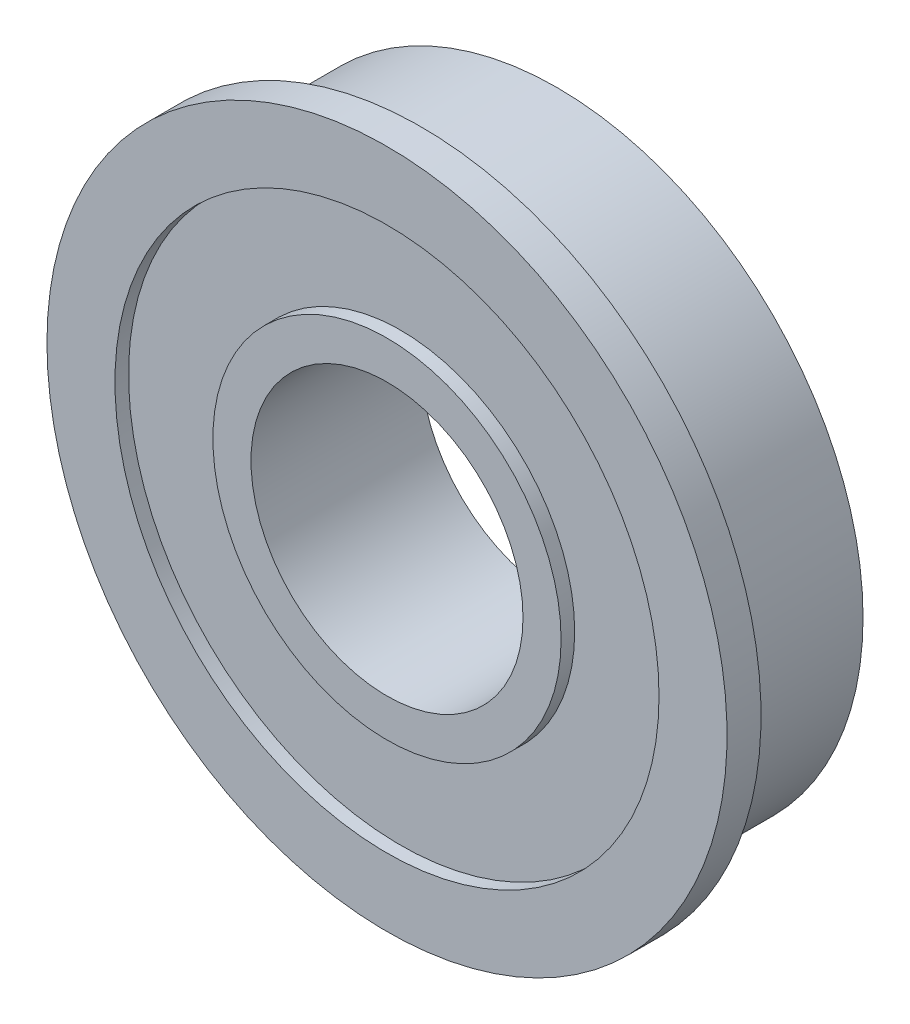
ISO-10303-21;
HEADER;
FILE_DESCRIPTION(('STEP AP214'),'2;1');
FILE_NAME('part.step','',(''),(''),'','','');
FILE_SCHEMA(('AUTOMOTIVE_DESIGN { 1 0 10303 214 1 1 1 1 }'));
ENDSEC;
DATA;
#1=APPLICATION_CONTEXT('core data for automotive mechanical design processes');
#2=APPLICATION_PROTOCOL_DEFINITION('international standard','automotive_design',2000,#1);
#3=PRODUCT_CONTEXT('',#1,'mechanical');
#4=PRODUCT('Part','Part','',(#3));
#5=PRODUCT_RELATED_PRODUCT_CATEGORY('part','',(#4));
#6=PRODUCT_DEFINITION_FORMATION('','',#4);
#7=PRODUCT_DEFINITION_CONTEXT('part definition',#1,'design');
#8=PRODUCT_DEFINITION('design','',#6,#7);
#9=PRODUCT_DEFINITION_SHAPE('','',#8);
#10=(LENGTH_UNIT() NAMED_UNIT(*) SI_UNIT(.MILLI.,.METRE.));
#11=(NAMED_UNIT(*) PLANE_ANGLE_UNIT() SI_UNIT($,.RADIAN.));
#12=(NAMED_UNIT(*) SI_UNIT($,.STERADIAN.) SOLID_ANGLE_UNIT());
#13=UNCERTAINTY_MEASURE_WITH_UNIT(LENGTH_MEASURE(1.E-05),#10,'distance_accuracy_value','');
#14=(GEOMETRIC_REPRESENTATION_CONTEXT(3) GLOBAL_UNCERTAINTY_ASSIGNED_CONTEXT((#13)) GLOBAL_UNIT_ASSIGNED_CONTEXT((#10,
#11,#12)) REPRESENTATION_CONTEXT('',''));
#15=CARTESIAN_POINT('',(0.,0.,0.));
#16=DIRECTION('',(0.,0.,1.));
#17=DIRECTION('',(1.,0.,0.));
#18=AXIS2_PLACEMENT_3D('',#15,#16,#17);
#19=CARTESIAN_POINT('',(0.738909090909089,0.,3.96875));
#20=DIRECTION('',(0.,0.,1.));
#21=DIRECTION('',(1.,0.,0.));
#22=AXIS2_PLACEMENT_3D('',#19,#20,#21);
#23=PLANE('',#22);
#24=CARTESIAN_POINT('',(0.,0.,3.96875));
#25=DIRECTION('',(0.,0.,1.));
#26=DIRECTION('',(1.,0.,0.));
#27=AXIS2_PLACEMENT_3D('',#24,#25,#26);
#28=CIRCLE('',#27,6.35);
#29=CARTESIAN_POINT('',(6.35,0.,3.96875));
#30=VERTEX_POINT('',#29);
#31=EDGE_CURVE('E58',#30,#30,#28,.F.);
#32=ORIENTED_EDGE('',*,*,#31,.T.);
#33=EDGE_LOOP('',(#32));
#34=FACE_BOUND('',#33,.T.);
#35=CARTESIAN_POINT('',(0.,0.,3.96875));
#36=DIRECTION('',(0.,0.,1.));
#37=DIRECTION('',(1.,0.,0.));
#38=AXIS2_PLACEMENT_3D('',#35,#36,#37);
#39=CIRCLE('',#38,8.128);
#40=CARTESIAN_POINT('',(8.128,0.,3.96875));
#41=VERTEX_POINT('',#40);
#42=EDGE_CURVE('E18',#41,#41,#39,.F.);
#43=ORIENTED_EDGE('',*,*,#42,.F.);
#44=EDGE_LOOP('',(#43));
#45=FACE_BOUND('',#44,.T.);
#46=ADVANCED_FACE('F15',(#34,#45),#23,.T.);
#47=CARTESIAN_POINT('',(0.,0.,0.));
#48=DIRECTION('',(0.,0.,1.));
#49=DIRECTION('',(1.,0.,0.));
#50=AXIS2_PLACEMENT_3D('',#47,#48,#49);
#51=CYLINDRICAL_SURFACE('',#50,8.128);
#52=CARTESIAN_POINT('',(0.,0.,3.33375));
#53=DIRECTION('',(0.,0.,1.));
#54=DIRECTION('',(1.,0.,0.));
#55=AXIS2_PLACEMENT_3D('',#52,#53,#54);
#56=CIRCLE('',#55,8.128);
#57=CARTESIAN_POINT('',(8.128,0.,3.33375));
#58=VERTEX_POINT('',#57);
#59=EDGE_CURVE('E56',#58,#58,#56,.F.);
#60=ORIENTED_EDGE('',*,*,#59,.F.);
#61=EDGE_LOOP('',(#60));
#62=FACE_BOUND('',#61,.T.);
#63=ORIENTED_EDGE('',*,*,#42,.T.);
#64=EDGE_LOOP('',(#63));
#65=FACE_BOUND('',#64,.T.);
#66=ADVANCED_FACE('F65',(#62,#65),#51,.T.);
#67=CARTESIAN_POINT('',(0.,0.,0.));
#68=DIRECTION('',(0.,0.,1.));
#69=DIRECTION('',(1.,0.,0.));
#70=AXIS2_PLACEMENT_3D('',#67,#68,#69);
#71=CYLINDRICAL_SURFACE('',#70,6.35);
#72=ORIENTED_EDGE('',*,*,#31,.F.);
#73=EDGE_LOOP('',(#72));
#74=FACE_BOUND('',#73,.T.);
#75=CARTESIAN_POINT('',(0.,0.,-3.96875));
#76=DIRECTION('',(0.,0.,1.));
#77=DIRECTION('',(1.,0.,0.));
#78=AXIS2_PLACEMENT_3D('',#75,#76,#77);
#79=CIRCLE('',#78,6.35);
#80=CARTESIAN_POINT('',(6.35,0.,-3.96875));
#81=VERTEX_POINT('',#80);
#82=EDGE_CURVE('E53',#81,#81,#79,.F.);
#83=ORIENTED_EDGE('',*,*,#82,.T.);
#84=EDGE_LOOP('',(#83));
#85=FACE_BOUND('',#84,.T.);
#86=ADVANCED_FACE('F72',(#74,#85),#71,.F.);
#87=CARTESIAN_POINT('',(1.15454545454544,0.,3.33375));
#88=DIRECTION('',(0.,0.,1.));
#89=DIRECTION('',(1.,0.,0.));
#90=AXIS2_PLACEMENT_3D('',#87,#88,#89);
#91=PLANE('',#90);
#92=ORIENTED_EDGE('',*,*,#59,.T.);
#93=EDGE_LOOP('',(#92));
#94=FACE_BOUND('',#93,.T.);
#95=CARTESIAN_POINT('',(0.,0.,3.33375));
#96=DIRECTION('',(0.,0.,1.));
#97=DIRECTION('',(1.,0.,0.));
#98=AXIS2_PLACEMENT_3D('',#95,#96,#97);
#99=CIRCLE('',#98,12.7);
#100=CARTESIAN_POINT('',(12.7,0.,3.33375));
#101=VERTEX_POINT('',#100);
#102=EDGE_CURVE('E50',#101,#101,#99,.T.);
#103=ORIENTED_EDGE('',*,*,#102,.T.);
#104=EDGE_LOOP('',(#103));
#105=FACE_BOUND('',#104,.T.);
#106=ADVANCED_FACE('F116',(#94,#105),#91,.T.);
#107=CARTESIAN_POINT('',(0.738909090909089,0.,-3.96875));
#108=DIRECTION('',(0.,0.,1.));
#109=DIRECTION('',(1.,0.,0.));
#110=AXIS2_PLACEMENT_3D('',#107,#108,#109);
#111=PLANE('',#110);
#112=ORIENTED_EDGE('',*,*,#82,.F.);
#113=EDGE_LOOP('',(#112));
#114=FACE_BOUND('',#113,.T.);
#115=CARTESIAN_POINT('',(0.,0.,-3.96875));
#116=DIRECTION('',(0.,0.,1.));
#117=DIRECTION('',(1.,0.,0.));
#118=AXIS2_PLACEMENT_3D('',#115,#116,#117);
#119=CIRCLE('',#118,8.128);
#120=CARTESIAN_POINT('',(8.128,0.,-3.96875));
#121=VERTEX_POINT('',#120);
#122=EDGE_CURVE('E47',#121,#121,#119,.T.);
#123=ORIENTED_EDGE('',*,*,#122,.F.);
#124=EDGE_LOOP('',(#123));
#125=FACE_BOUND('',#124,.T.);
#126=ADVANCED_FACE('F112',(#114,#125),#111,.F.);
#127=CARTESIAN_POINT('',(0.,0.,0.));
#128=DIRECTION('',(0.,0.,1.));
#129=DIRECTION('',(1.,0.,0.));
#130=AXIS2_PLACEMENT_3D('',#127,#128,#129);
#131=CYLINDRICAL_SURFACE('',#130,12.7);
#132=ORIENTED_EDGE('',*,*,#102,.F.);
#133=EDGE_LOOP('',(#132));
#134=FACE_BOUND('',#133,.T.);
#135=CARTESIAN_POINT('',(0.,0.,3.96875));
#136=DIRECTION('',(0.,0.,1.));
#137=DIRECTION('',(1.,0.,0.));
#138=AXIS2_PLACEMENT_3D('',#135,#136,#137);
#139=CIRCLE('',#138,12.7);
#140=CARTESIAN_POINT('',(12.7,0.,3.96875));
#141=VERTEX_POINT('',#140);
#142=EDGE_CURVE('E44',#141,#141,#139,.F.);
#143=ORIENTED_EDGE('',*,*,#142,.F.);
#144=EDGE_LOOP('',(#143));
#145=FACE_BOUND('',#144,.T.);
#146=ADVANCED_FACE('F108',(#134,#145),#131,.F.);
#147=CARTESIAN_POINT('',(0.,0.,0.));
#148=DIRECTION('',(0.,0.,1.));
#149=DIRECTION('',(1.,0.,0.));
#150=AXIS2_PLACEMENT_3D('',#147,#148,#149);
#151=CYLINDRICAL_SURFACE('',#150,8.128);
#152=ORIENTED_EDGE('',*,*,#122,.T.);
#153=EDGE_LOOP('',(#152));
#154=FACE_BOUND('',#153,.T.);
#155=CARTESIAN_POINT('',(0.,0.,-3.33375));
#156=DIRECTION('',(0.,0.,1.));
#157=DIRECTION('',(1.,0.,0.));
#158=AXIS2_PLACEMENT_3D('',#155,#156,#157);
#159=CIRCLE('',#158,8.128);
#160=CARTESIAN_POINT('',(8.128,0.,-3.33375));
#161=VERTEX_POINT('',#160);
#162=EDGE_CURVE('E41',#161,#161,#159,.F.);
#163=ORIENTED_EDGE('',*,*,#162,.T.);
#164=EDGE_LOOP('',(#163));
#165=FACE_BOUND('',#164,.T.);
#166=ADVANCED_FACE('F104',(#154,#165),#151,.T.);
#167=CARTESIAN_POINT('',(1.29886363636365,0.,3.96875));
#168=DIRECTION('',(0.,0.,1.));
#169=DIRECTION('',(1.,0.,0.));
#170=AXIS2_PLACEMENT_3D('',#167,#168,#169);
#171=PLANE('',#170);
#172=ORIENTED_EDGE('',*,*,#142,.T.);
#173=EDGE_LOOP('',(#172));
#174=FACE_BOUND('',#173,.T.);
#175=CARTESIAN_POINT('',(0.,0.,3.96875));
#176=DIRECTION('',(0.,0.,-1.));
#177=DIRECTION('',(-1.,0.,0.));
#178=AXIS2_PLACEMENT_3D('',#175,#176,#177);
#179=CIRCLE('',#178,15.875);
#180=CARTESIAN_POINT('',(-15.875,0.,3.96875));
#181=VERTEX_POINT('',#180);
#182=EDGE_CURVE('E38',#181,#181,#179,.T.);
#183=ORIENTED_EDGE('',*,*,#182,.F.);
#184=EDGE_LOOP('',(#183));
#185=FACE_BOUND('',#184,.T.);
#186=ADVANCED_FACE('F100',(#174,#185),#171,.T.);
#187=CARTESIAN_POINT('',(1.15454545454544,0.,-3.33375));
#188=DIRECTION('',(0.,0.,1.));
#189=DIRECTION('',(1.,0.,0.));
#190=AXIS2_PLACEMENT_3D('',#187,#188,#189);
#191=PLANE('',#190);
#192=ORIENTED_EDGE('',*,*,#162,.F.);
#193=EDGE_LOOP('',(#192));
#194=FACE_BOUND('',#193,.T.);
#195=CARTESIAN_POINT('',(0.,0.,-3.33375));
#196=DIRECTION('',(0.,0.,1.));
#197=DIRECTION('',(1.,0.,0.));
#198=AXIS2_PLACEMENT_3D('',#195,#196,#197);
#199=CIRCLE('',#198,12.7);
#200=CARTESIAN_POINT('',(12.7,0.,-3.33375));
#201=VERTEX_POINT('',#200);
#202=EDGE_CURVE('E35',#201,#201,#199,.F.);
#203=ORIENTED_EDGE('',*,*,#202,.T.);
#204=EDGE_LOOP('',(#203));
#205=FACE_BOUND('',#204,.T.);
#206=ADVANCED_FACE('F96',(#194,#205),#191,.F.);
#207=CARTESIAN_POINT('',(0.,0.,3.96875));
#208=DIRECTION('',(0.,0.,-1.));
#209=DIRECTION('',(-1.,0.,0.));
#210=AXIS2_PLACEMENT_3D('',#207,#208,#209);
#211=CYLINDRICAL_SURFACE('',#210,15.875);
#212=ORIENTED_EDGE('',*,*,#182,.T.);
#213=EDGE_LOOP('',(#212));
#214=FACE_BOUND('',#213,.T.);
#215=CARTESIAN_POINT('',(0.,0.,2.38125));
#216=DIRECTION('',(0.,0.,-1.));
#217=DIRECTION('',(-1.,0.,0.));
#218=AXIS2_PLACEMENT_3D('',#215,#216,#217);
#219=CIRCLE('',#218,15.875);
#220=CARTESIAN_POINT('',(-15.875,0.,2.38125));
#221=VERTEX_POINT('',#220);
#222=EDGE_CURVE('E32',#221,#221,#219,.F.);
#223=ORIENTED_EDGE('',*,*,#222,.T.);
#224=EDGE_LOOP('',(#223));
#225=FACE_BOUND('',#224,.T.);
#226=ADVANCED_FACE('F92',(#214,#225),#211,.T.);
#227=CARTESIAN_POINT('',(0.,0.,0.));
#228=DIRECTION('',(0.,0.,1.));
#229=DIRECTION('',(1.,0.,0.));
#230=AXIS2_PLACEMENT_3D('',#227,#228,#229);
#231=CYLINDRICAL_SURFACE('',#230,12.7);
#232=ORIENTED_EDGE('',*,*,#202,.F.);
#233=EDGE_LOOP('',(#232));
#234=FACE_BOUND('',#233,.T.);
#235=CARTESIAN_POINT('',(0.,0.,-3.96875));
#236=DIRECTION('',(0.,0.,1.));
#237=DIRECTION('',(1.,0.,0.));
#238=AXIS2_PLACEMENT_3D('',#235,#236,#237);
#239=CIRCLE('',#238,12.7);
#240=CARTESIAN_POINT('',(12.7,0.,-3.96875));
#241=VERTEX_POINT('',#240);
#242=EDGE_CURVE('E27',#241,#241,#239,.F.);
#243=ORIENTED_EDGE('',*,*,#242,.T.);
#244=EDGE_LOOP('',(#243));
#245=FACE_BOUND('',#244,.T.);
#246=ADVANCED_FACE('F88',(#234,#245),#231,.F.);
#247=CARTESIAN_POINT('',(1.44318181818182,0.,2.38125));
#248=DIRECTION('',(0.,0.,1.));
#249=DIRECTION('',(1.,0.,0.));
#250=AXIS2_PLACEMENT_3D('',#247,#248,#249);
#251=PLANE('',#250);
#252=CARTESIAN_POINT('',(0.,0.,2.38125));
#253=DIRECTION('',(0.,0.,1.));
#254=DIRECTION('',(1.,0.,0.));
#255=AXIS2_PLACEMENT_3D('',#252,#253,#254);
#256=CIRCLE('',#255,14.2875);
#257=CARTESIAN_POINT('',(14.2875,0.,2.38125));
#258=VERTEX_POINT('',#257);
#259=EDGE_CURVE('E22',#258,#258,#256,.F.);
#260=ORIENTED_EDGE('',*,*,#259,.F.);
#261=EDGE_LOOP('',(#260));
#262=FACE_BOUND('',#261,.T.);
#263=ORIENTED_EDGE('',*,*,#222,.F.);
#264=EDGE_LOOP('',(#263));
#265=FACE_BOUND('',#264,.T.);
#266=ADVANCED_FACE('F81',(#262,#265),#251,.F.);
#267=CARTESIAN_POINT('',(1.29886363636365,0.,-3.96875));
#268=DIRECTION('',(0.,0.,1.));
#269=DIRECTION('',(1.,0.,0.));
#270=AXIS2_PLACEMENT_3D('',#267,#268,#269);
#271=PLANE('',#270);
#272=ORIENTED_EDGE('',*,*,#242,.F.);
#273=EDGE_LOOP('',(#272));
#274=FACE_BOUND('',#273,.T.);
#275=CARTESIAN_POINT('',(0.,0.,-3.96875));
#276=DIRECTION('',(0.,0.,1.));
#277=DIRECTION('',(1.,0.,0.));
#278=AXIS2_PLACEMENT_3D('',#275,#276,#277);
#279=CIRCLE('',#278,14.2875);
#280=CARTESIAN_POINT('',(14.2875,0.,-3.96875));
#281=VERTEX_POINT('',#280);
#282=EDGE_CURVE('E10',#281,#281,#279,.T.);
#283=ORIENTED_EDGE('',*,*,#282,.F.);
#284=EDGE_LOOP('',(#283));
#285=FACE_BOUND('',#284,.T.);
#286=ADVANCED_FACE('F76',(#274,#285),#271,.F.);
#287=CARTESIAN_POINT('',(0.,0.,0.));
#288=DIRECTION('',(0.,0.,1.));
#289=DIRECTION('',(1.,0.,0.));
#290=AXIS2_PLACEMENT_3D('',#287,#288,#289);
#291=CYLINDRICAL_SURFACE('',#290,14.2875);
#292=ORIENTED_EDGE('',*,*,#282,.T.);
#293=EDGE_LOOP('',(#292));
#294=FACE_BOUND('',#293,.T.);
#295=ORIENTED_EDGE('',*,*,#259,.T.);
#296=EDGE_LOOP('',(#295));
#297=FACE_BOUND('',#296,.T.);
#298=ADVANCED_FACE('F74',(#294,#297),#291,.T.);
#299=CLOSED_SHELL('',(#46,#66,#86,#106,#126,#146,#166,#186,#206,#226,#246,#266,#286,#298));
#300=MANIFOLD_SOLID_BREP('B1',#299);
#301=ADVANCED_BREP_SHAPE_REPRESENTATION('',(#18,#300),#14);
#302=SHAPE_DEFINITION_REPRESENTATION(#9,#301);
ENDSEC;
END-ISO-10303-21;
